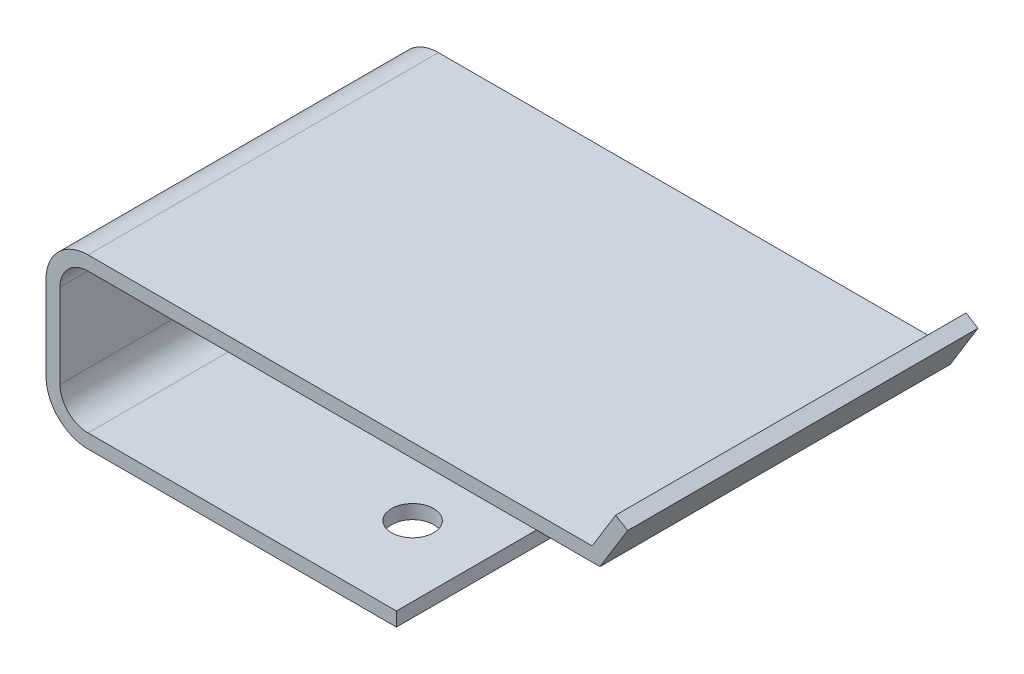
ISO-10303-21;
HEADER;
FILE_DESCRIPTION(('STEP AP214'),'2;1');
FILE_NAME('part.step','',(''),(''),'','','');
FILE_SCHEMA(('AUTOMOTIVE_DESIGN { 1 0 10303 214 1 1 1 1 }'));
ENDSEC;
DATA;
#1=APPLICATION_CONTEXT('core data for automotive mechanical design processes');
#2=APPLICATION_PROTOCOL_DEFINITION('international standard','automotive_design',2000,#1);
#3=PRODUCT_CONTEXT('',#1,'mechanical');
#4=PRODUCT('Part','Part','',(#3));
#5=PRODUCT_RELATED_PRODUCT_CATEGORY('part','',(#4));
#6=PRODUCT_DEFINITION_FORMATION('','',#4);
#7=PRODUCT_DEFINITION_CONTEXT('part definition',#1,'design');
#8=PRODUCT_DEFINITION('design','',#6,#7);
#9=PRODUCT_DEFINITION_SHAPE('','',#8);
#10=(LENGTH_UNIT() NAMED_UNIT(*) SI_UNIT(.MILLI.,.METRE.));
#11=(NAMED_UNIT(*) PLANE_ANGLE_UNIT() SI_UNIT($,.RADIAN.));
#12=(NAMED_UNIT(*) SI_UNIT($,.STERADIAN.) SOLID_ANGLE_UNIT());
#13=UNCERTAINTY_MEASURE_WITH_UNIT(LENGTH_MEASURE(1.E-05),#10,'distance_accuracy_value','');
#14=(GEOMETRIC_REPRESENTATION_CONTEXT(3) GLOBAL_UNCERTAINTY_ASSIGNED_CONTEXT((#13)) GLOBAL_UNIT_ASSIGNED_CONTEXT((#10,
#11,#12)) REPRESENTATION_CONTEXT('',''));
#15=CARTESIAN_POINT('',(0.,0.,0.));
#16=DIRECTION('',(0.,0.,1.));
#17=DIRECTION('',(1.,0.,0.));
#18=AXIS2_PLACEMENT_3D('',#15,#16,#17);
#19=CARTESIAN_POINT('',(14.8168521392858,11.4769487207691,25.));
#20=DIRECTION('',(-0.852301213946626,0.523051279230926,0.));
#21=DIRECTION('',(-0.523051279230926,-0.852301213946626,0.));
#22=AXIS2_PLACEMENT_3D('',#19,#20,#21);
#23=PLANE('',#22);
#24=DIRECTION('',(0.523051279230926,0.852301213946626,0.));
#25=VECTOR('',#24,1.);
#26=CARTESIAN_POINT('',(14.8168521392858,11.4769487207691,0.));
#27=LINE('',#26,#25);
#28=CARTESIAN_POINT('',(14.5241520533964,11.,0.));
#29=VERTEX_POINT('',#28);
#30=CARTESIAN_POINT('',(16.4973572610432,14.2152969711037,0.));
#31=VERTEX_POINT('',#30);
#32=EDGE_CURVE('E167',#29,#31,#27,.T.);
#33=ORIENTED_EDGE('',*,*,#32,.T.);
#34=DIRECTION('',(0.,0.,-1.));
#35=VECTOR('',#34,1.);
#36=CARTESIAN_POINT('',(16.4973572610432,14.2152969711037,25.));
#37=LINE('',#36,#35);
#38=CARTESIAN_POINT('',(16.4973572610432,14.2152969711037,25.));
#39=VERTEX_POINT('',#38);
#40=EDGE_CURVE('E11',#39,#31,#37,.T.);
#41=ORIENTED_EDGE('',*,*,#40,.F.);
#42=DIRECTION('',(0.523051279230926,0.852301213946626,0.));
#43=VECTOR('',#42,1.);
#44=CARTESIAN_POINT('',(14.8168521392858,11.4769487207691,25.));
#45=LINE('',#44,#43);
#46=CARTESIAN_POINT('',(14.5241520533964,11.,25.));
#47=VERTEX_POINT('',#46);
#48=EDGE_CURVE('E107',#47,#39,#45,.T.);
#49=ORIENTED_EDGE('',*,*,#48,.F.);
#50=DIRECTION('',(0.,0.,-1.));
#51=VECTOR('',#50,1.);
#52=CARTESIAN_POINT('',(14.5241520533964,11.,25.));
#53=LINE('',#52,#51);
#54=EDGE_CURVE('E163',#47,#29,#53,.T.);
#55=ORIENTED_EDGE('',*,*,#54,.T.);
#56=EDGE_LOOP('',(#33,#41,#49,#55));
#57=FACE_BOUND('',#56,.T.);
#58=ADVANCED_FACE('F33',(#57),#23,.F.);
#59=CARTESIAN_POINT('',(15.6450560470965,14.7383482503346,25.));
#60=DIRECTION('',(0.523051279230927,0.852301213946625,0.));
#61=DIRECTION('',(-0.852301213946625,0.523051279230927,0.));
#62=AXIS2_PLACEMENT_3D('',#59,#60,#61);
#63=PLANE('',#62);
#64=DIRECTION('',(0.852301213946625,-0.523051279230927,0.));
#65=VECTOR('',#64,1.);
#66=CARTESIAN_POINT('',(15.6450560470965,14.7383482503346,0.));
#67=LINE('',#66,#65);
#68=CARTESIAN_POINT('',(15.6450560470965,14.7383482503346,0.));
#69=VERTEX_POINT('',#68);
#70=EDGE_CURVE('E170',#69,#31,#67,.T.);
#71=ORIENTED_EDGE('',*,*,#70,.F.);
#72=DIRECTION('',(0.,0.,-1.));
#73=VECTOR('',#72,1.);
#74=CARTESIAN_POINT('',(15.6450560470965,14.7383482503346,25.));
#75=LINE('',#74,#73);
#76=CARTESIAN_POINT('',(15.6450560470965,14.7383482503346,25.));
#77=VERTEX_POINT('',#76);
#78=EDGE_CURVE('E42',#77,#69,#75,.T.);
#79=ORIENTED_EDGE('',*,*,#78,.F.);
#80=DIRECTION('',(0.852301213946625,-0.523051279230927,0.));
#81=VECTOR('',#80,1.);
#82=CARTESIAN_POINT('',(15.6450560470965,14.7383482503346,25.));
#83=LINE('',#82,#81);
#84=EDGE_CURVE('E236',#77,#39,#83,.T.);
#85=ORIENTED_EDGE('',*,*,#84,.T.);
#86=ORIENTED_EDGE('',*,*,#40,.T.);
#87=EDGE_LOOP('',(#71,#79,#85,#86));
#88=FACE_BOUND('',#87,.T.);
#89=ADVANCED_FACE('F276',(#88),#63,.T.);
#90=CARTESIAN_POINT('',(13.9645509253392,12.,25.));
#91=DIRECTION('',(-0.852301213946626,0.523051279230926,0.));
#92=DIRECTION('',(-0.523051279230926,-0.852301213946626,0.));
#93=AXIS2_PLACEMENT_3D('',#90,#91,#92);
#94=PLANE('',#93);
#95=DIRECTION('',(0.523051279230926,0.852301213946626,0.));
#96=VECTOR('',#95,1.);
#97=CARTESIAN_POINT('',(13.9645509253392,12.,0.));
#98=LINE('',#97,#96);
#99=CARTESIAN_POINT('',(13.9645509253392,12.,0.));
#100=VERTEX_POINT('',#99);
#101=EDGE_CURVE('E174',#100,#69,#98,.T.);
#102=ORIENTED_EDGE('',*,*,#101,.F.);
#103=DIRECTION('',(0.,0.,-1.));
#104=VECTOR('',#103,1.);
#105=CARTESIAN_POINT('',(13.9645509253392,12.,25.));
#106=LINE('',#105,#104);
#107=CARTESIAN_POINT('',(13.9645509253392,12.,25.));
#108=VERTEX_POINT('',#107);
#109=EDGE_CURVE('E220',#108,#100,#106,.T.);
#110=ORIENTED_EDGE('',*,*,#109,.F.);
#111=DIRECTION('',(0.523051279230926,0.852301213946626,0.));
#112=VECTOR('',#111,1.);
#113=CARTESIAN_POINT('',(13.9645509253392,12.,25.));
#114=LINE('',#113,#112);
#115=EDGE_CURVE('E239',#108,#77,#114,.T.);
#116=ORIENTED_EDGE('',*,*,#115,.T.);
#117=ORIENTED_EDGE('',*,*,#78,.T.);
#118=EDGE_LOOP('',(#102,#110,#116,#117));
#119=FACE_BOUND('',#118,.T.);
#120=ADVANCED_FACE('F280',(#119),#94,.T.);
#121=CARTESIAN_POINT('',(-22.,12.,25.));
#122=DIRECTION('',(0.,1.,0.));
#123=DIRECTION('',(0.,0.,1.));
#124=AXIS2_PLACEMENT_3D('',#121,#122,#123);
#125=PLANE('',#124);
#126=DIRECTION('',(1.,0.,0.));
#127=VECTOR('',#126,1.);
#128=CARTESIAN_POINT('',(-22.,12.,0.));
#129=LINE('',#128,#127);
#130=CARTESIAN_POINT('',(-22.,12.,0.));
#131=VERTEX_POINT('',#130);
#132=EDGE_CURVE('E177',#131,#100,#129,.T.);
#133=ORIENTED_EDGE('',*,*,#132,.F.);
#134=DIRECTION('',(0.,0.,-1.));
#135=VECTOR('',#134,1.);
#136=CARTESIAN_POINT('',(-22.,12.,25.));
#137=LINE('',#136,#135);
#138=CARTESIAN_POINT('',(-22.,12.,25.));
#139=VERTEX_POINT('',#138);
#140=EDGE_CURVE('E218',#139,#131,#137,.T.);
#141=ORIENTED_EDGE('',*,*,#140,.F.);
#142=DIRECTION('',(1.,0.,0.));
#143=VECTOR('',#142,1.);
#144=CARTESIAN_POINT('',(-10.,12.,25.));
#145=LINE('',#144,#143);
#146=EDGE_CURVE('E242',#139,#108,#145,.T.);
#147=ORIENTED_EDGE('',*,*,#146,.T.);
#148=ORIENTED_EDGE('',*,*,#109,.T.);
#149=EDGE_LOOP('',(#133,#141,#147,#148));
#150=FACE_BOUND('',#149,.T.);
#151=ADVANCED_FACE('F283',(#150),#125,.T.);
#152=CARTESIAN_POINT('',(-22.,9.,25.));
#153=DIRECTION('',(0.,0.,-1.));
#154=DIRECTION('',(-1.,0.,0.));
#155=AXIS2_PLACEMENT_3D('',#152,#153,#154);
#156=CYLINDRICAL_SURFACE('',#155,3.);
#157=CARTESIAN_POINT('',(-22.,9.,0.));
#158=DIRECTION('',(0.,0.,-1.));
#159=DIRECTION('',(1.,0.,0.));
#160=AXIS2_PLACEMENT_3D('',#157,#158,#159);
#161=CIRCLE('',#160,3.);
#162=CARTESIAN_POINT('',(-25.,8.99999999999998,0.));
#163=VERTEX_POINT('',#162);
#164=EDGE_CURVE('E179',#163,#131,#161,.T.);
#165=ORIENTED_EDGE('',*,*,#164,.F.);
#166=DIRECTION('',(0.,0.,-1.));
#167=VECTOR('',#166,1.);
#168=CARTESIAN_POINT('',(-25.,8.99999999999998,25.));
#169=LINE('',#168,#167);
#170=CARTESIAN_POINT('',(-25.,8.99999999999998,25.));
#171=VERTEX_POINT('',#170);
#172=EDGE_CURVE('E216',#171,#163,#169,.T.);
#173=ORIENTED_EDGE('',*,*,#172,.F.);
#174=CARTESIAN_POINT('',(-22.,9.,25.));
#175=DIRECTION('',(0.,0.,-1.));
#176=DIRECTION('',(1.,0.,0.));
#177=AXIS2_PLACEMENT_3D('',#174,#175,#176);
#178=CIRCLE('',#177,3.);
#179=EDGE_CURVE('E245',#171,#139,#178,.T.);
#180=ORIENTED_EDGE('',*,*,#179,.T.);
#181=ORIENTED_EDGE('',*,*,#140,.T.);
#182=EDGE_LOOP('',(#165,#173,#180,#181));
#183=FACE_BOUND('',#182,.T.);
#184=ADVANCED_FACE('F302',(#183),#156,.T.);
#185=CARTESIAN_POINT('',(-25.,3.00000000000002,25.));
#186=DIRECTION('',(-1.,0.,0.));
#187=DIRECTION('',(0.,0.,1.));
#188=AXIS2_PLACEMENT_3D('',#185,#186,#187);
#189=PLANE('',#188);
#190=DIRECTION('',(0.,1.,0.));
#191=VECTOR('',#190,1.);
#192=CARTESIAN_POINT('',(-25.,3.00000000000002,0.));
#193=LINE('',#192,#191);
#194=CARTESIAN_POINT('',(-25.,3.00000000000002,0.));
#195=VERTEX_POINT('',#194);
#196=EDGE_CURVE('E182',#195,#163,#193,.T.);
#197=ORIENTED_EDGE('',*,*,#196,.F.);
#198=DIRECTION('',(0.,0.,-1.));
#199=VECTOR('',#198,1.);
#200=CARTESIAN_POINT('',(-25.,3.00000000000002,25.));
#201=LINE('',#200,#199);
#202=CARTESIAN_POINT('',(-25.,3.00000000000002,25.));
#203=VERTEX_POINT('',#202);
#204=EDGE_CURVE('E214',#203,#195,#201,.T.);
#205=ORIENTED_EDGE('',*,*,#204,.F.);
#206=DIRECTION('',(0.,1.,0.));
#207=VECTOR('',#206,1.);
#208=CARTESIAN_POINT('',(-25.,3.00000000000002,25.));
#209=LINE('',#208,#207);
#210=EDGE_CURVE('E248',#203,#171,#209,.T.);
#211=ORIENTED_EDGE('',*,*,#210,.T.);
#212=ORIENTED_EDGE('',*,*,#172,.T.);
#213=EDGE_LOOP('',(#197,#205,#211,#212));
#214=FACE_BOUND('',#213,.T.);
#215=ADVANCED_FACE('F291',(#214),#189,.T.);
#216=CARTESIAN_POINT('',(-22.,3.,25.));
#217=DIRECTION('',(0.,0.,-1.));
#218=DIRECTION('',(-1.,0.,0.));
#219=AXIS2_PLACEMENT_3D('',#216,#217,#218);
#220=CYLINDRICAL_SURFACE('',#219,3.);
#221=CARTESIAN_POINT('',(-22.,3.,0.));
#222=DIRECTION('',(0.,0.,-1.));
#223=DIRECTION('',(1.,0.,0.));
#224=AXIS2_PLACEMENT_3D('',#221,#222,#223);
#225=CIRCLE('',#224,3.);
#226=CARTESIAN_POINT('',(-22.,0.,0.));
#227=VERTEX_POINT('',#226);
#228=EDGE_CURVE('E185',#227,#195,#225,.T.);
#229=ORIENTED_EDGE('',*,*,#228,.F.);
#230=DIRECTION('',(0.,0.,-1.));
#231=VECTOR('',#230,1.);
#232=CARTESIAN_POINT('',(-22.,0.,25.));
#233=LINE('',#232,#231);
#234=CARTESIAN_POINT('',(-22.,0.,25.));
#235=VERTEX_POINT('',#234);
#236=EDGE_CURVE('E212',#235,#227,#233,.T.);
#237=ORIENTED_EDGE('',*,*,#236,.F.);
#238=CARTESIAN_POINT('',(-22.,3.,25.));
#239=DIRECTION('',(0.,0.,-1.));
#240=DIRECTION('',(1.,0.,0.));
#241=AXIS2_PLACEMENT_3D('',#238,#239,#240);
#242=CIRCLE('',#241,3.);
#243=EDGE_CURVE('E251',#235,#203,#242,.T.);
#244=ORIENTED_EDGE('',*,*,#243,.T.);
#245=ORIENTED_EDGE('',*,*,#204,.T.);
#246=EDGE_LOOP('',(#229,#237,#244,#245));
#247=FACE_BOUND('',#246,.T.);
#248=ADVANCED_FACE('F295',(#247),#220,.T.);
#249=CARTESIAN_POINT('',(0.,0.,25.));
#250=DIRECTION('',(0.,-1.,0.));
#251=DIRECTION('',(1.,0.,0.));
#252=AXIS2_PLACEMENT_3D('',#249,#250,#251);
#253=PLANE('',#252);
#254=CARTESIAN_POINT('',(-5.00000000000001,0.,3.90460735717792));
#255=DIRECTION('',(0.,-1.,0.));
#256=DIRECTION('',(1.,0.,0.));
#257=AXIS2_PLACEMENT_3D('',#254,#255,#256);
#258=CIRCLE('',#257,1.5);
#259=CARTESIAN_POINT('',(-3.5,0.,3.90460735717792));
#260=VERTEX_POINT('',#259);
#261=EDGE_CURVE('E232',#260,#260,#258,.T.);
#262=ORIENTED_EDGE('',*,*,#261,.F.);
#263=EDGE_LOOP('',(#262));
#264=FACE_BOUND('',#263,.T.);
#265=CARTESIAN_POINT('',(-5.,0.,18.8423769717783));
#266=DIRECTION('',(0.,-1.,0.));
#267=DIRECTION('',(1.,0.,0.));
#268=AXIS2_PLACEMENT_3D('',#265,#266,#267);
#269=CIRCLE('',#268,1.5);
#270=CARTESIAN_POINT('',(-3.5,0.,18.8423769717783));
#271=VERTEX_POINT('',#270);
#272=EDGE_CURVE('E224',#271,#271,#269,.T.);
#273=ORIENTED_EDGE('',*,*,#272,.F.);
#274=EDGE_LOOP('',(#273));
#275=FACE_BOUND('',#274,.T.);
#276=DIRECTION('',(-1.,0.,0.));
#277=VECTOR('',#276,1.);
#278=CARTESIAN_POINT('',(0.,0.,0.));
#279=LINE('',#278,#277);
#280=CARTESIAN_POINT('',(0.,0.,0.));
#281=VERTEX_POINT('',#280);
#282=EDGE_CURVE('E188',#281,#227,#279,.T.);
#283=ORIENTED_EDGE('',*,*,#282,.F.);
#284=DIRECTION('',(0.,0.,-1.));
#285=VECTOR('',#284,1.);
#286=CARTESIAN_POINT('',(0.,0.,25.));
#287=LINE('',#286,#285);
#288=CARTESIAN_POINT('',(0.,0.,25.));
#289=VERTEX_POINT('',#288);
#290=EDGE_CURVE('E210',#289,#281,#287,.T.);
#291=ORIENTED_EDGE('',*,*,#290,.F.);
#292=DIRECTION('',(-1.,0.,0.));
#293=VECTOR('',#292,1.);
#294=CARTESIAN_POINT('',(0.,0.,25.));
#295=LINE('',#294,#293);
#296=EDGE_CURVE('E254',#289,#235,#295,.T.);
#297=ORIENTED_EDGE('',*,*,#296,.T.);
#298=ORIENTED_EDGE('',*,*,#236,.T.);
#299=EDGE_LOOP('',(#283,#291,#297,#298));
#300=FACE_BOUND('',#299,.T.);
#301=ADVANCED_FACE('F298',(#264,#275,#300),#253,.T.);
#302=CARTESIAN_POINT('',(0.,1.,25.));
#303=DIRECTION('',(1.,0.,0.));
#304=DIRECTION('',(0.,1.,0.));
#305=AXIS2_PLACEMENT_3D('',#302,#303,#304);
#306=PLANE('',#305);
#307=DIRECTION('',(0.,-1.,0.));
#308=VECTOR('',#307,1.);
#309=CARTESIAN_POINT('',(0.,1.,0.));
#310=LINE('',#309,#308);
#311=CARTESIAN_POINT('',(0.,1.,0.));
#312=VERTEX_POINT('',#311);
#313=EDGE_CURVE('E191',#312,#281,#310,.T.);
#314=ORIENTED_EDGE('',*,*,#313,.F.);
#315=DIRECTION('',(0.,0.,-1.));
#316=VECTOR('',#315,1.);
#317=CARTESIAN_POINT('',(0.,1.,25.));
#318=LINE('',#317,#316);
#319=CARTESIAN_POINT('',(0.,1.,25.));
#320=VERTEX_POINT('',#319);
#321=EDGE_CURVE('E208',#320,#312,#318,.T.);
#322=ORIENTED_EDGE('',*,*,#321,.F.);
#323=DIRECTION('',(0.,-1.,0.));
#324=VECTOR('',#323,1.);
#325=CARTESIAN_POINT('',(0.,1.,25.));
#326=LINE('',#325,#324);
#327=EDGE_CURVE('E257',#320,#289,#326,.T.);
#328=ORIENTED_EDGE('',*,*,#327,.T.);
#329=ORIENTED_EDGE('',*,*,#290,.T.);
#330=EDGE_LOOP('',(#314,#322,#328,#329));
#331=FACE_BOUND('',#330,.T.);
#332=ADVANCED_FACE('F301',(#331),#306,.T.);
#333=CARTESIAN_POINT('',(0.,1.,25.));
#334=DIRECTION('',(0.,-1.,0.));
#335=DIRECTION('',(1.,0.,0.));
#336=AXIS2_PLACEMENT_3D('',#333,#334,#335);
#337=PLANE('',#336);
#338=CARTESIAN_POINT('',(-5.00000000000001,0.999999999999999,3.90460735717792));
#339=DIRECTION('',(0.,-1.,0.));
#340=DIRECTION('',(1.,0.,0.));
#341=AXIS2_PLACEMENT_3D('',#338,#339,#340);
#342=CIRCLE('',#341,1.5);
#343=CARTESIAN_POINT('',(-3.5,0.999999999999999,3.90460735717792));
#344=VERTEX_POINT('',#343);
#345=EDGE_CURVE('E36',#344,#344,#342,.T.);
#346=ORIENTED_EDGE('',*,*,#345,.T.);
#347=EDGE_LOOP('',(#346));
#348=FACE_BOUND('',#347,.T.);
#349=CARTESIAN_POINT('',(-5.,0.999999999999999,18.8423769717783));
#350=DIRECTION('',(0.,-1.,0.));
#351=DIRECTION('',(1.,0.,0.));
#352=AXIS2_PLACEMENT_3D('',#349,#350,#351);
#353=CIRCLE('',#352,1.5);
#354=CARTESIAN_POINT('',(-3.5,0.999999999999999,18.8423769717783));
#355=VERTEX_POINT('',#354);
#356=EDGE_CURVE('E171',#355,#355,#353,.T.);
#357=ORIENTED_EDGE('',*,*,#356,.T.);
#358=EDGE_LOOP('',(#357));
#359=FACE_BOUND('',#358,.T.);
#360=DIRECTION('',(-1.,0.,0.));
#361=VECTOR('',#360,1.);
#362=CARTESIAN_POINT('',(0.,1.,0.));
#363=LINE('',#362,#361);
#364=CARTESIAN_POINT('',(-22.,0.999999999999998,0.));
#365=VERTEX_POINT('',#364);
#366=EDGE_CURVE('E194',#312,#365,#363,.T.);
#367=ORIENTED_EDGE('',*,*,#366,.T.);
#368=DIRECTION('',(0.,0.,-1.));
#369=VECTOR('',#368,1.);
#370=CARTESIAN_POINT('',(-22.,0.999999999999998,25.));
#371=LINE('',#370,#369);
#372=CARTESIAN_POINT('',(-22.,0.999999999999998,25.));
#373=VERTEX_POINT('',#372);
#374=EDGE_CURVE('E205',#373,#365,#371,.T.);
#375=ORIENTED_EDGE('',*,*,#374,.F.);
#376=DIRECTION('',(-1.,0.,0.));
#377=VECTOR('',#376,1.);
#378=CARTESIAN_POINT('',(0.,1.,25.));
#379=LINE('',#378,#377);
#380=EDGE_CURVE('E260',#320,#373,#379,.T.);
#381=ORIENTED_EDGE('',*,*,#380,.F.);
#382=ORIENTED_EDGE('',*,*,#321,.T.);
#383=EDGE_LOOP('',(#367,#375,#381,#382));
#384=FACE_BOUND('',#383,.T.);
#385=ADVANCED_FACE('F266',(#348,#359,#384),#337,.F.);
#386=CARTESIAN_POINT('',(-22.,3.,25.));
#387=DIRECTION('',(0.,0.,-1.));
#388=DIRECTION('',(-1.,0.,0.));
#389=AXIS2_PLACEMENT_3D('',#386,#387,#388);
#390=CYLINDRICAL_SURFACE('',#389,2.);
#391=CARTESIAN_POINT('',(-22.,3.,0.));
#392=DIRECTION('',(0.,0.,1.));
#393=DIRECTION('',(1.,0.,0.));
#394=AXIS2_PLACEMENT_3D('',#391,#392,#393);
#395=CIRCLE('',#394,2.);
#396=CARTESIAN_POINT('',(-24.,3.00000000000002,0.));
#397=VERTEX_POINT('',#396);
#398=EDGE_CURVE('E196',#365,#397,#395,.F.);
#399=ORIENTED_EDGE('',*,*,#398,.T.);
#400=DIRECTION('',(0.,0.,-1.));
#401=VECTOR('',#400,1.);
#402=CARTESIAN_POINT('',(-24.,3.00000000000002,25.));
#403=LINE('',#402,#401);
#404=CARTESIAN_POINT('',(-24.,3.00000000000002,25.));
#405=VERTEX_POINT('',#404);
#406=EDGE_CURVE('E158',#405,#397,#403,.T.);
#407=ORIENTED_EDGE('',*,*,#406,.F.);
#408=CARTESIAN_POINT('',(-22.,3.,25.));
#409=DIRECTION('',(0.,0.,1.));
#410=DIRECTION('',(1.,0.,0.));
#411=AXIS2_PLACEMENT_3D('',#408,#409,#410);
#412=CIRCLE('',#411,2.);
#413=EDGE_CURVE('E147',#373,#405,#412,.F.);
#414=ORIENTED_EDGE('',*,*,#413,.F.);
#415=ORIENTED_EDGE('',*,*,#374,.T.);
#416=EDGE_LOOP('',(#399,#407,#414,#415));
#417=FACE_BOUND('',#416,.T.);
#418=ADVANCED_FACE('F270',(#417),#390,.F.);
#419=CARTESIAN_POINT('',(-24.,3.00000000000002,25.));
#420=DIRECTION('',(-1.,0.,0.));
#421=DIRECTION('',(0.,0.,1.));
#422=AXIS2_PLACEMENT_3D('',#419,#420,#421);
#423=PLANE('',#422);
#424=DIRECTION('',(0.,1.,0.));
#425=VECTOR('',#424,1.);
#426=CARTESIAN_POINT('',(-24.,3.00000000000002,0.));
#427=LINE('',#426,#425);
#428=CARTESIAN_POINT('',(-24.,8.99999999999998,0.));
#429=VERTEX_POINT('',#428);
#430=EDGE_CURVE('E156',#397,#429,#427,.T.);
#431=ORIENTED_EDGE('',*,*,#430,.T.);
#432=DIRECTION('',(0.,0.,-1.));
#433=VECTOR('',#432,1.);
#434=CARTESIAN_POINT('',(-24.,8.99999999999998,25.));
#435=LINE('',#434,#433);
#436=CARTESIAN_POINT('',(-24.,8.99999999999998,25.));
#437=VERTEX_POINT('',#436);
#438=EDGE_CURVE('E153',#437,#429,#435,.T.);
#439=ORIENTED_EDGE('',*,*,#438,.F.);
#440=DIRECTION('',(0.,1.,0.));
#441=VECTOR('',#440,1.);
#442=CARTESIAN_POINT('',(-24.,3.00000000000002,25.));
#443=LINE('',#442,#441);
#444=EDGE_CURVE('E140',#405,#437,#443,.T.);
#445=ORIENTED_EDGE('',*,*,#444,.F.);
#446=ORIENTED_EDGE('',*,*,#406,.T.);
#447=EDGE_LOOP('',(#431,#439,#445,#446));
#448=FACE_BOUND('',#447,.T.);
#449=ADVANCED_FACE('F154',(#448),#423,.F.);
#450=CARTESIAN_POINT('',(-22.,9.,25.));
#451=DIRECTION('',(0.,0.,-1.));
#452=DIRECTION('',(-1.,0.,0.));
#453=AXIS2_PLACEMENT_3D('',#450,#451,#452);
#454=CYLINDRICAL_SURFACE('',#453,2.);
#455=CARTESIAN_POINT('',(-22.,9.,0.));
#456=DIRECTION('',(0.,0.,1.));
#457=DIRECTION('',(1.,0.,0.));
#458=AXIS2_PLACEMENT_3D('',#455,#456,#457);
#459=CIRCLE('',#458,2.);
#460=CARTESIAN_POINT('',(-22.,11.,0.));
#461=VERTEX_POINT('',#460);
#462=EDGE_CURVE('E199',#429,#461,#459,.F.);
#463=ORIENTED_EDGE('',*,*,#462,.T.);
#464=DIRECTION('',(0.,0.,-1.));
#465=VECTOR('',#464,1.);
#466=CARTESIAN_POINT('',(-22.,11.,25.));
#467=LINE('',#466,#465);
#468=CARTESIAN_POINT('',(-22.,11.,25.));
#469=VERTEX_POINT('',#468);
#470=EDGE_CURVE('E159',#469,#461,#467,.T.);
#471=ORIENTED_EDGE('',*,*,#470,.F.);
#472=CARTESIAN_POINT('',(-22.,9.,25.));
#473=DIRECTION('',(0.,0.,1.));
#474=DIRECTION('',(1.,0.,0.));
#475=AXIS2_PLACEMENT_3D('',#472,#473,#474);
#476=CIRCLE('',#475,2.);
#477=EDGE_CURVE('E144',#437,#469,#476,.F.);
#478=ORIENTED_EDGE('',*,*,#477,.F.);
#479=ORIENTED_EDGE('',*,*,#438,.T.);
#480=EDGE_LOOP('',(#463,#471,#478,#479));
#481=FACE_BOUND('',#480,.T.);
#482=ADVANCED_FACE('F161',(#481),#454,.F.);
#483=CARTESIAN_POINT('',(-10.,11.,25.));
#484=DIRECTION('',(0.,1.,0.));
#485=DIRECTION('',(0.,0.,1.));
#486=AXIS2_PLACEMENT_3D('',#483,#484,#485);
#487=PLANE('',#486);
#488=DIRECTION('',(1.,0.,0.));
#489=VECTOR('',#488,1.);
#490=CARTESIAN_POINT('',(-10.,11.,0.));
#491=LINE('',#490,#489);
#492=EDGE_CURVE('E97',#461,#29,#491,.T.);
#493=ORIENTED_EDGE('',*,*,#492,.T.);
#494=ORIENTED_EDGE('',*,*,#54,.F.);
#495=DIRECTION('',(1.,0.,0.));
#496=VECTOR('',#495,1.);
#497=CARTESIAN_POINT('',(-22.,11.,25.));
#498=LINE('',#497,#496);
#499=EDGE_CURVE('E51',#469,#47,#498,.T.);
#500=ORIENTED_EDGE('',*,*,#499,.F.);
#501=ORIENTED_EDGE('',*,*,#470,.T.);
#502=EDGE_LOOP('',(#493,#494,#500,#501));
#503=FACE_BOUND('',#502,.T.);
#504=ADVANCED_FACE('F272',(#503),#487,.F.);
#505=CARTESIAN_POINT('',(-22.,9.,25.));
#506=DIRECTION('',(0.,0.,-1.));
#507=DIRECTION('',(-1.,0.,0.));
#508=AXIS2_PLACEMENT_3D('',#505,#506,#507);
#509=PLANE('',#508);
#510=ORIENTED_EDGE('',*,*,#48,.T.);
#511=ORIENTED_EDGE('',*,*,#84,.F.);
#512=ORIENTED_EDGE('',*,*,#115,.F.);
#513=ORIENTED_EDGE('',*,*,#146,.F.);
#514=ORIENTED_EDGE('',*,*,#179,.F.);
#515=ORIENTED_EDGE('',*,*,#210,.F.);
#516=ORIENTED_EDGE('',*,*,#243,.F.);
#517=ORIENTED_EDGE('',*,*,#296,.F.);
#518=ORIENTED_EDGE('',*,*,#327,.F.);
#519=ORIENTED_EDGE('',*,*,#380,.T.);
#520=ORIENTED_EDGE('',*,*,#413,.T.);
#521=ORIENTED_EDGE('',*,*,#444,.T.);
#522=ORIENTED_EDGE('',*,*,#477,.T.);
#523=ORIENTED_EDGE('',*,*,#499,.T.);
#524=EDGE_LOOP('',(#510,#511,#512,#513,#514,#515,#516,#517,#518,#519,#520,#521,#522,#523));
#525=FACE_BOUND('',#524,.T.);
#526=ADVANCED_FACE('F142',(#525),#509,.F.);
#527=CARTESIAN_POINT('',(-22.,9.,0.));
#528=DIRECTION('',(0.,0.,-1.));
#529=DIRECTION('',(-1.,0.,0.));
#530=AXIS2_PLACEMENT_3D('',#527,#528,#529);
#531=PLANE('',#530);
#532=ORIENTED_EDGE('',*,*,#32,.F.);
#533=ORIENTED_EDGE('',*,*,#492,.F.);
#534=ORIENTED_EDGE('',*,*,#462,.F.);
#535=ORIENTED_EDGE('',*,*,#430,.F.);
#536=ORIENTED_EDGE('',*,*,#398,.F.);
#537=ORIENTED_EDGE('',*,*,#366,.F.);
#538=ORIENTED_EDGE('',*,*,#313,.T.);
#539=ORIENTED_EDGE('',*,*,#282,.T.);
#540=ORIENTED_EDGE('',*,*,#228,.T.);
#541=ORIENTED_EDGE('',*,*,#196,.T.);
#542=ORIENTED_EDGE('',*,*,#164,.T.);
#543=ORIENTED_EDGE('',*,*,#132,.T.);
#544=ORIENTED_EDGE('',*,*,#101,.T.);
#545=ORIENTED_EDGE('',*,*,#70,.T.);
#546=EDGE_LOOP('',(#532,#533,#534,#535,#536,#537,#538,#539,#540,#541,#542,#543,#544,#545));
#547=FACE_BOUND('',#546,.T.);
#548=ADVANCED_FACE('F271',(#547),#531,.T.);
#549=CARTESIAN_POINT('',(-5.00000000000001,5.,18.8423769717783));
#550=DIRECTION('',(0.,-1.,0.));
#551=DIRECTION('',(1.,0.,0.));
#552=AXIS2_PLACEMENT_3D('',#549,#550,#551);
#553=CYLINDRICAL_SURFACE('',#552,1.5);
#554=ORIENTED_EDGE('',*,*,#272,.T.);
#555=EDGE_LOOP('',(#554));
#556=FACE_BOUND('',#555,.T.);
#557=ORIENTED_EDGE('',*,*,#356,.F.);
#558=EDGE_LOOP('',(#557));
#559=FACE_BOUND('',#558,.T.);
#560=ADVANCED_FACE('F406',(#556,#559),#553,.F.);
#561=CARTESIAN_POINT('',(-5.00000000000001,5.,3.90460735717792));
#562=DIRECTION('',(0.,-1.,0.));
#563=DIRECTION('',(1.,0.,0.));
#564=AXIS2_PLACEMENT_3D('',#561,#562,#563);
#565=CYLINDRICAL_SURFACE('',#564,1.5);
#566=ORIENTED_EDGE('',*,*,#261,.T.);
#567=EDGE_LOOP('',(#566));
#568=FACE_BOUND('',#567,.T.);
#569=ORIENTED_EDGE('',*,*,#345,.F.);
#570=EDGE_LOOP('',(#569));
#571=FACE_BOUND('',#570,.T.);
#572=ADVANCED_FACE('F429',(#568,#571),#565,.F.);
#573=CLOSED_SHELL('',(#58,#89,#120,#151,#184,#215,#248,#301,#332,#385,#418,#449,#482,#504,#526,
#548,#560,#572));
#574=MANIFOLD_SOLID_BREP('B2',#573);
#575=ADVANCED_BREP_SHAPE_REPRESENTATION('',(#18,#574),#14);
#576=SHAPE_DEFINITION_REPRESENTATION(#9,#575);
ENDSEC;
END-ISO-10303-21;
